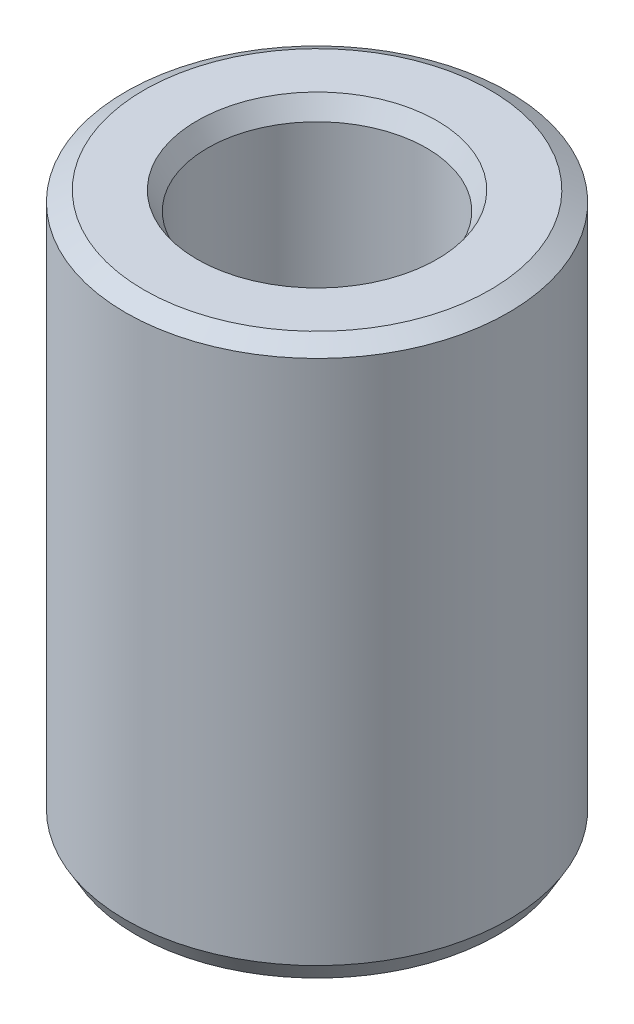
ISO-10303-21;
HEADER;
FILE_DESCRIPTION(('STEP AP214'),'2;1');
FILE_NAME('part.step','',(''),(''),'','','');
FILE_SCHEMA(('AUTOMOTIVE_DESIGN { 1 0 10303 214 1 1 1 1 }'));
ENDSEC;
DATA;
#1=APPLICATION_CONTEXT('core data for automotive mechanical design processes');
#2=APPLICATION_PROTOCOL_DEFINITION('international standard','automotive_design',2000,#1);
#3=PRODUCT_CONTEXT('',#1,'mechanical');
#4=PRODUCT('Part','Part','',(#3));
#5=PRODUCT_RELATED_PRODUCT_CATEGORY('part','',(#4));
#6=PRODUCT_DEFINITION_FORMATION('','',#4);
#7=PRODUCT_DEFINITION_CONTEXT('part definition',#1,'design');
#8=PRODUCT_DEFINITION('design','',#6,#7);
#9=PRODUCT_DEFINITION_SHAPE('','',#8);
#10=(LENGTH_UNIT() NAMED_UNIT(*) SI_UNIT(.MILLI.,.METRE.));
#11=(NAMED_UNIT(*) PLANE_ANGLE_UNIT() SI_UNIT($,.RADIAN.));
#12=(NAMED_UNIT(*) SI_UNIT($,.STERADIAN.) SOLID_ANGLE_UNIT());
#13=UNCERTAINTY_MEASURE_WITH_UNIT(LENGTH_MEASURE(1.E-05),#10,'distance_accuracy_value','');
#14=(GEOMETRIC_REPRESENTATION_CONTEXT(3) GLOBAL_UNCERTAINTY_ASSIGNED_CONTEXT((#13)) GLOBAL_UNIT_ASSIGNED_CONTEXT((#10,
#11,#12)) REPRESENTATION_CONTEXT('',''));
#15=CARTESIAN_POINT('',(0.,0.,0.));
#16=DIRECTION('',(0.,0.,1.));
#17=DIRECTION('',(1.,0.,0.));
#18=AXIS2_PLACEMENT_3D('',#15,#16,#17);
#19=CARTESIAN_POINT('',(0.,72.4510785454703,0.));
#20=DIRECTION('',(0.,-1.,0.));
#21=DIRECTION('',(0.,0.,-1.));
#22=AXIS2_PLACEMENT_3D('',#19,#20,#21);
#23=CYLINDRICAL_SURFACE('',#22,25.);
#24=CARTESIAN_POINT('',(0.,2.39072355502858,0.));
#25=DIRECTION('',(0.,1.,0.));
#26=DIRECTION('',(0.,0.,1.));
#27=AXIS2_PLACEMENT_3D('',#24,#25,#26);
#28=CIRCLE('',#27,25.);
#29=CARTESIAN_POINT('',(0.,2.39072355502858,25.));
#30=VERTEX_POINT('',#29);
#31=EDGE_CURVE('E10',#30,#30,#28,.T.);
#32=ORIENTED_EDGE('',*,*,#31,.T.);
#33=EDGE_LOOP('',(#32));
#34=FACE_BOUND('',#33,.T.);
#35=CARTESIAN_POINT('',(0.,71.0707936574166,0.));
#36=DIRECTION('',(0.,1.,0.));
#37=DIRECTION('',(0.,0.,1.));
#38=AXIS2_PLACEMENT_3D('',#35,#36,#37);
#39=CIRCLE('',#38,25.);
#40=CARTESIAN_POINT('',(0.,71.0707936574166,25.));
#41=VERTEX_POINT('',#40);
#42=EDGE_CURVE('E50',#41,#41,#39,.F.);
#43=ORIENTED_EDGE('',*,*,#42,.T.);
#44=EDGE_LOOP('',(#43));
#45=FACE_BOUND('',#44,.T.);
#46=ADVANCED_FACE('F39',(#34,#45),#23,.T.);
#47=CARTESIAN_POINT('',(0.,72.4510785454703,0.));
#48=DIRECTION('',(0.,1.,0.));
#49=DIRECTION('',(0.,0.,1.));
#50=AXIS2_PLACEMENT_3D('',#47,#48,#49);
#51=PLANE('',#50);
#52=CARTESIAN_POINT('',(0.,72.4510785454703,0.));
#53=DIRECTION('',(0.,1.,0.));
#54=DIRECTION('',(0.,0.,1.));
#55=AXIS2_PLACEMENT_3D('',#52,#53,#54);
#56=CIRCLE('',#55,15.6780367777838);
#57=CARTESIAN_POINT('',(0.,72.4510785454703,15.6780367777838));
#58=VERTEX_POINT('',#57);
#59=EDGE_CURVE('E58',#58,#58,#56,.F.);
#60=ORIENTED_EDGE('',*,*,#59,.T.);
#61=EDGE_LOOP('',(#60));
#62=FACE_BOUND('',#61,.T.);
#63=CARTESIAN_POINT('',(0.,72.4510785454703,0.));
#64=DIRECTION('',(0.,1.,0.));
#65=DIRECTION('',(0.,0.,1.));
#66=AXIS2_PLACEMENT_3D('',#63,#64,#65);
#67=CIRCLE('',#66,22.6092764449714);
#68=CARTESIAN_POINT('',(0.,72.4510785454703,22.6092764449714));
#69=VERTEX_POINT('',#68);
#70=EDGE_CURVE('E61',#69,#69,#67,.T.);
#71=ORIENTED_EDGE('',*,*,#70,.T.);
#72=EDGE_LOOP('',(#71));
#73=FACE_BOUND('',#72,.T.);
#74=ADVANCED_FACE('F88',(#62,#73),#51,.T.);
#75=CARTESIAN_POINT('',(0.,0.,0.));
#76=DIRECTION('',(0.,1.,0.));
#77=DIRECTION('',(0.,0.,1.));
#78=AXIS2_PLACEMENT_3D('',#75,#76,#77);
#79=PLANE('',#78);
#80=CARTESIAN_POINT('',(0.,0.,0.));
#81=DIRECTION('',(0.,1.,0.));
#82=DIRECTION('',(0.,0.,1.));
#83=AXIS2_PLACEMENT_3D('',#80,#81,#82);
#84=CIRCLE('',#83,16.6884754447586);
#85=CARTESIAN_POINT('',(0.,0.,16.6884754447586));
#86=VERTEX_POINT('',#85);
#87=EDGE_CURVE('E51',#86,#86,#84,.T.);
#88=ORIENTED_EDGE('',*,*,#87,.T.);
#89=EDGE_LOOP('',(#88));
#90=FACE_BOUND('',#89,.T.);
#91=CARTESIAN_POINT('',(0.,0.,0.));
#92=DIRECTION('',(0.,1.,0.));
#93=DIRECTION('',(0.,0.,1.));
#94=AXIS2_PLACEMENT_3D('',#91,#92,#93);
#95=CIRCLE('',#94,23.6197151119463);
#96=CARTESIAN_POINT('',(0.,0.,23.6197151119463));
#97=VERTEX_POINT('',#96);
#98=EDGE_CURVE('E54',#97,#97,#95,.F.);
#99=ORIENTED_EDGE('',*,*,#98,.T.);
#100=EDGE_LOOP('',(#99));
#101=FACE_BOUND('',#100,.T.);
#102=ADVANCED_FACE('F83',(#90,#101),#79,.F.);
#103=CARTESIAN_POINT('',(0.,72.4510785454703,0.));
#104=DIRECTION('',(0.,-1.,0.));
#105=DIRECTION('',(0.,0.,-1.));
#106=AXIS2_PLACEMENT_3D('',#103,#104,#105);
#107=CYLINDRICAL_SURFACE('',#106,14.29775188973);
#108=CARTESIAN_POINT('',(0.,70.0603549904417,0.));
#109=DIRECTION('',(0.,1.,0.));
#110=DIRECTION('',(0.,0.,1.));
#111=AXIS2_PLACEMENT_3D('',#108,#109,#110);
#112=CIRCLE('',#111,14.29775188973);
#113=CARTESIAN_POINT('',(0.,70.0603549904417,14.29775188973));
#114=VERTEX_POINT('',#113);
#115=EDGE_CURVE('E67',#114,#114,#112,.T.);
#116=ORIENTED_EDGE('',*,*,#115,.T.);
#117=EDGE_LOOP('',(#116));
#118=FACE_BOUND('',#117,.T.);
#119=CARTESIAN_POINT('',(0.,1.38028488805375,0.));
#120=DIRECTION('',(0.,1.,0.));
#121=DIRECTION('',(0.,0.,1.));
#122=AXIS2_PLACEMENT_3D('',#119,#120,#121);
#123=CIRCLE('',#122,14.29775188973);
#124=CARTESIAN_POINT('',(0.,1.38028488805375,14.29775188973));
#125=VERTEX_POINT('',#124);
#126=EDGE_CURVE('E69',#125,#125,#123,.F.);
#127=ORIENTED_EDGE('',*,*,#126,.T.);
#128=EDGE_LOOP('',(#127));
#129=FACE_BOUND('',#128,.T.);
#130=ADVANCED_FACE('F71',(#118,#129),#107,.F.);
#131=CARTESIAN_POINT('',(0.,70.0603549904417,0.));
#132=DIRECTION('',(0.,1.,0.));
#133=DIRECTION('',(0.,0.,1.));
#134=AXIS2_PLACEMENT_3D('',#131,#132,#133);
#135=CONICAL_SURFACE('',#134,14.29775188973,0.523598775598299);
#136=ORIENTED_EDGE('',*,*,#59,.F.);
#137=EDGE_LOOP('',(#136));
#138=FACE_BOUND('',#137,.T.);
#139=ORIENTED_EDGE('',*,*,#115,.F.);
#140=EDGE_LOOP('',(#139));
#141=FACE_BOUND('',#140,.T.);
#142=ADVANCED_FACE('F77',(#138,#141),#135,.F.);
#143=CARTESIAN_POINT('',(0.,0.,0.));
#144=DIRECTION('',(0.,-1.,0.));
#145=DIRECTION('',(0.,0.,-1.));
#146=AXIS2_PLACEMENT_3D('',#143,#144,#145);
#147=CONICAL_SURFACE('',#146,16.6884754447586,1.04719755119659);
#148=ORIENTED_EDGE('',*,*,#126,.F.);
#149=EDGE_LOOP('',(#148));
#150=FACE_BOUND('',#149,.T.);
#151=ORIENTED_EDGE('',*,*,#87,.F.);
#152=EDGE_LOOP('',(#151));
#153=FACE_BOUND('',#152,.T.);
#154=ADVANCED_FACE('F73',(#150,#153),#147,.F.);
#155=CARTESIAN_POINT('',(0.,2.39072355502858,0.));
#156=DIRECTION('',(0.,1.,0.));
#157=DIRECTION('',(0.,0.,1.));
#158=AXIS2_PLACEMENT_3D('',#155,#156,#157);
#159=CONICAL_SURFACE('',#158,25.,0.523598775598303);
#160=ORIENTED_EDGE('',*,*,#98,.F.);
#161=EDGE_LOOP('',(#160));
#162=FACE_BOUND('',#161,.T.);
#163=ORIENTED_EDGE('',*,*,#31,.F.);
#164=EDGE_LOOP('',(#163));
#165=FACE_BOUND('',#164,.T.);
#166=ADVANCED_FACE('F76',(#162,#165),#159,.T.);
#167=CARTESIAN_POINT('',(0.,72.4510785454703,0.));
#168=DIRECTION('',(0.,-1.,0.));
#169=DIRECTION('',(0.,0.,-1.));
#170=AXIS2_PLACEMENT_3D('',#167,#168,#169);
#171=CONICAL_SURFACE('',#170,22.6092764449714,1.0471975511966);
#172=ORIENTED_EDGE('',*,*,#42,.F.);
#173=EDGE_LOOP('',(#172));
#174=FACE_BOUND('',#173,.T.);
#175=ORIENTED_EDGE('',*,*,#70,.F.);
#176=EDGE_LOOP('',(#175));
#177=FACE_BOUND('',#176,.T.);
#178=ADVANCED_FACE('F45',(#174,#177),#171,.T.);
#179=CLOSED_SHELL('',(#46,#74,#102,#130,#142,#154,#166,#178));
#180=MANIFOLD_SOLID_BREP('B2',#179);
#181=ADVANCED_BREP_SHAPE_REPRESENTATION('',(#18,#180),#14);
#182=SHAPE_DEFINITION_REPRESENTATION(#9,#181);
ENDSEC;
END-ISO-10303-21;
